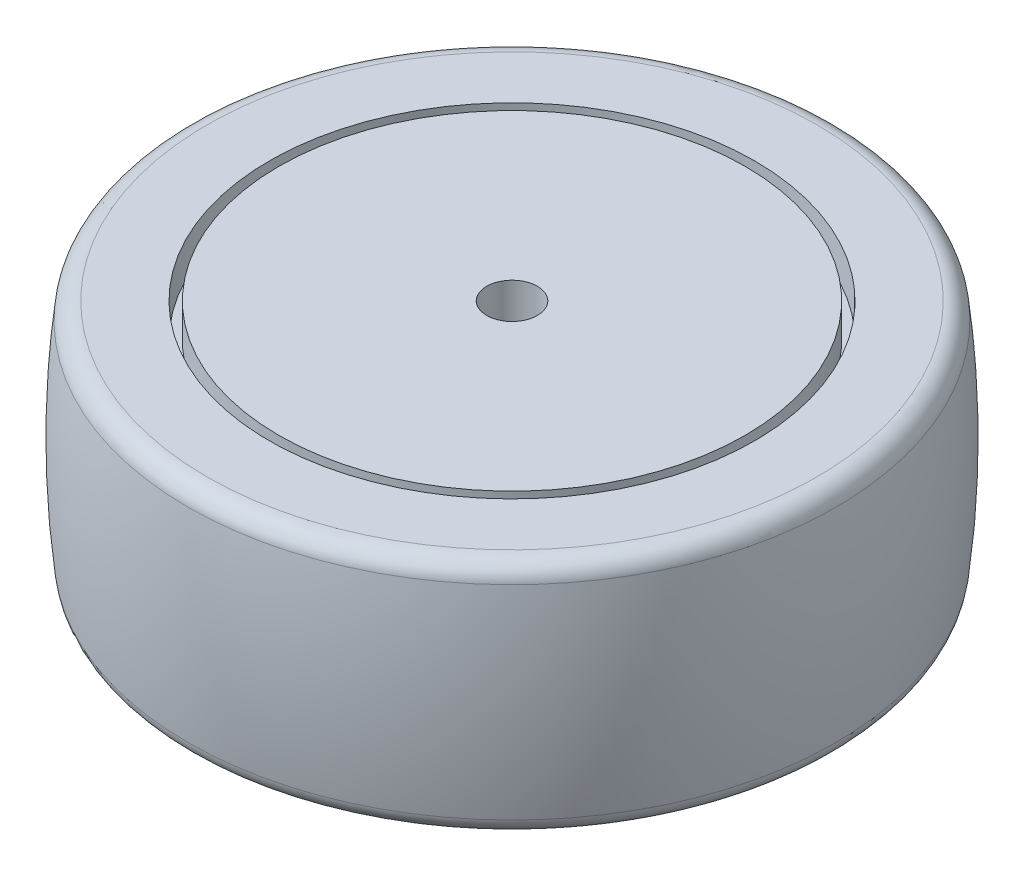
ISO-10303-21;
HEADER;
FILE_DESCRIPTION(('STEP AP214'),'2;1');
FILE_NAME('part.step','',(''),(''),'','','');
FILE_SCHEMA(('AUTOMOTIVE_DESIGN { 1 0 10303 214 1 1 1 1 }'));
ENDSEC;
DATA;
#1=APPLICATION_CONTEXT('core data for automotive mechanical design processes');
#2=APPLICATION_PROTOCOL_DEFINITION('international standard','automotive_design',2000,#1);
#3=PRODUCT_CONTEXT('',#1,'mechanical');
#4=PRODUCT('Part','Part','',(#3));
#5=PRODUCT_RELATED_PRODUCT_CATEGORY('part','',(#4));
#6=PRODUCT_DEFINITION_FORMATION('','',#4);
#7=PRODUCT_DEFINITION_CONTEXT('part definition',#1,'design');
#8=PRODUCT_DEFINITION('design','',#6,#7);
#9=PRODUCT_DEFINITION_SHAPE('','',#8);
#10=(LENGTH_UNIT() NAMED_UNIT(*) SI_UNIT(.MILLI.,.METRE.));
#11=(NAMED_UNIT(*) PLANE_ANGLE_UNIT() SI_UNIT($,.RADIAN.));
#12=(NAMED_UNIT(*) SI_UNIT($,.STERADIAN.) SOLID_ANGLE_UNIT());
#13=UNCERTAINTY_MEASURE_WITH_UNIT(LENGTH_MEASURE(1.E-05),#10,'distance_accuracy_value','');
#14=(GEOMETRIC_REPRESENTATION_CONTEXT(3) GLOBAL_UNCERTAINTY_ASSIGNED_CONTEXT((#13)) GLOBAL_UNIT_ASSIGNED_CONTEXT((#10,
#11,#12)) REPRESENTATION_CONTEXT('',''));
#15=CARTESIAN_POINT('',(0.,0.,0.));
#16=DIRECTION('',(0.,0.,1.));
#17=DIRECTION('',(1.,0.,0.));
#18=AXIS2_PLACEMENT_3D('',#15,#16,#17);
#19=CARTESIAN_POINT('',(0.,18.75,0.));
#20=DIRECTION('',(0.,1.,0.));
#21=DIRECTION('',(0.,0.,1.));
#22=AXIS2_PLACEMENT_3D('',#19,#20,#21);
#23=PLANE('',#22);
#24=CARTESIAN_POINT('',(0.,18.75,0.));
#25=DIRECTION('',(0.,1.,0.));
#26=DIRECTION('',(0.,0.,1.));
#27=AXIS2_PLACEMENT_3D('',#24,#25,#26);
#28=CIRCLE('',#27,48.147149503569);
#29=CARTESIAN_POINT('',(0.,18.75,48.147149503569));
#30=VERTEX_POINT('',#29);
#31=EDGE_CURVE('E10',#30,#30,#28,.T.);
#32=ORIENTED_EDGE('',*,*,#31,.T.);
#33=EDGE_LOOP('',(#32));
#34=FACE_BOUND('',#33,.T.);
#35=CARTESIAN_POINT('',(0.,18.75,0.));
#36=DIRECTION('',(0.,-1.,0.));
#37=DIRECTION('',(0.,0.,-1.));
#38=AXIS2_PLACEMENT_3D('',#35,#36,#37);
#39=CIRCLE('',#38,38.3);
#40=CARTESIAN_POINT('',(0.,18.75,-38.3));
#41=VERTEX_POINT('',#40);
#42=EDGE_CURVE('E75',#41,#41,#39,.T.);
#43=ORIENTED_EDGE('',*,*,#42,.T.);
#44=EDGE_LOOP('',(#43));
#45=FACE_BOUND('',#44,.T.);
#46=ADVANCED_FACE('F34',(#34,#45),#23,.T.);
#47=CARTESIAN_POINT('',(0.,0.,0.));
#48=DIRECTION('',(0.,-1.,0.));
#49=DIRECTION('',(0.,0.,-1.));
#50=AXIS2_PLACEMENT_3D('',#47,#48,#49);
#51=DEGENERATE_TOROIDAL_SURFACE('',#50,90.3852773521191,142.424875078038,.F.);
#52=CARTESIAN_POINT('',(0.,-16.0888921809939,0.));
#53=DIRECTION('',(0.,1.,0.));
#54=DIRECTION('',(0.,0.,1.));
#55=AXIS2_PLACEMENT_3D('',#52,#53,#54);
#56=CIRCLE('',#55,51.1279467274105);
#57=CARTESIAN_POINT('',(0.,-16.0888921809939,51.1279467274105));
#58=VERTEX_POINT('',#57);
#59=EDGE_CURVE('E41',#58,#58,#56,.T.);
#60=ORIENTED_EDGE('',*,*,#59,.T.);
#61=EDGE_LOOP('',(#60));
#62=FACE_BOUND('',#61,.T.);
#63=CARTESIAN_POINT('',(0.,16.0888921809939,0.));
#64=DIRECTION('',(0.,-1.,0.));
#65=DIRECTION('',(0.,0.,-1.));
#66=AXIS2_PLACEMENT_3D('',#63,#64,#65);
#67=CIRCLE('',#66,51.1279467274105);
#68=CARTESIAN_POINT('',(0.,16.0888921809939,-51.1279467274105));
#69=VERTEX_POINT('',#68);
#70=EDGE_CURVE('E45',#69,#69,#67,.T.);
#71=ORIENTED_EDGE('',*,*,#70,.T.);
#72=EDGE_LOOP('',(#71));
#73=FACE_BOUND('',#72,.T.);
#74=ADVANCED_FACE('F114',(#62,#73),#51,.F.);
#75=CARTESIAN_POINT('',(0.,-18.75,0.));
#76=DIRECTION('',(0.,1.,0.));
#77=DIRECTION('',(0.,0.,1.));
#78=AXIS2_PLACEMENT_3D('',#75,#76,#77);
#79=PLANE('',#78);
#80=CARTESIAN_POINT('',(0.,-18.75,0.));
#81=DIRECTION('',(0.,1.,0.));
#82=DIRECTION('',(0.,0.,1.));
#83=AXIS2_PLACEMENT_3D('',#80,#81,#82);
#84=CIRCLE('',#83,48.147149503569);
#85=CARTESIAN_POINT('',(0.,-18.75,48.147149503569));
#86=VERTEX_POINT('',#85);
#87=EDGE_CURVE('E49',#86,#86,#84,.F.);
#88=ORIENTED_EDGE('',*,*,#87,.T.);
#89=EDGE_LOOP('',(#88));
#90=FACE_BOUND('',#89,.T.);
#91=CARTESIAN_POINT('',(0.,-18.75,0.));
#92=DIRECTION('',(0.,-1.,0.));
#93=DIRECTION('',(0.,0.,-1.));
#94=AXIS2_PLACEMENT_3D('',#91,#92,#93);
#95=CIRCLE('',#94,38.3);
#96=CARTESIAN_POINT('',(0.,-18.75,-38.3));
#97=VERTEX_POINT('',#96);
#98=EDGE_CURVE('E54',#97,#97,#95,.T.);
#99=ORIENTED_EDGE('',*,*,#98,.F.);
#100=EDGE_LOOP('',(#99));
#101=FACE_BOUND('',#100,.T.);
#102=ADVANCED_FACE('F119',(#90,#101),#79,.F.);
#103=CARTESIAN_POINT('',(0.,-18.75,0.));
#104=DIRECTION('',(0.,-1.,0.));
#105=DIRECTION('',(0.,0.,-1.));
#106=AXIS2_PLACEMENT_3D('',#103,#104,#105);
#107=CYLINDRICAL_SURFACE('',#106,38.3);
#108=CARTESIAN_POINT('',(0.,-13.2825304000738,0.));
#109=DIRECTION('',(0.,-1.,0.));
#110=DIRECTION('',(0.,0.,-1.));
#111=AXIS2_PLACEMENT_3D('',#108,#109,#110);
#112=CIRCLE('',#111,38.3);
#113=CARTESIAN_POINT('',(0.,-13.2825304000738,-38.3));
#114=VERTEX_POINT('',#113);
#115=EDGE_CURVE('E57',#114,#114,#112,.T.);
#116=ORIENTED_EDGE('',*,*,#115,.F.);
#117=EDGE_LOOP('',(#116));
#118=FACE_BOUND('',#117,.T.);
#119=ORIENTED_EDGE('',*,*,#98,.T.);
#120=EDGE_LOOP('',(#119));
#121=FACE_BOUND('',#120,.T.);
#122=ADVANCED_FACE('F133',(#118,#121),#107,.F.);
#123=CARTESIAN_POINT('',(0.,-13.2825304000738,0.));
#124=DIRECTION('',(0.,1.,0.));
#125=DIRECTION('',(0.,0.,1.));
#126=AXIS2_PLACEMENT_3D('',#123,#124,#125);
#127=PLANE('',#126);
#128=CARTESIAN_POINT('',(0.,-13.2825304000738,0.));
#129=DIRECTION('',(0.,-1.,0.));
#130=DIRECTION('',(0.,0.,-1.));
#131=AXIS2_PLACEMENT_3D('',#128,#129,#130);
#132=CIRCLE('',#131,36.8);
#133=CARTESIAN_POINT('',(0.,-13.2825304000738,-36.8));
#134=VERTEX_POINT('',#133);
#135=EDGE_CURVE('E60',#134,#134,#132,.T.);
#136=ORIENTED_EDGE('',*,*,#135,.F.);
#137=EDGE_LOOP('',(#136));
#138=FACE_BOUND('',#137,.T.);
#139=ORIENTED_EDGE('',*,*,#115,.T.);
#140=EDGE_LOOP('',(#139));
#141=FACE_BOUND('',#140,.T.);
#142=ADVANCED_FACE('F137',(#138,#141),#127,.F.);
#143=CARTESIAN_POINT('',(0.,-18.75,0.));
#144=DIRECTION('',(0.,-1.,0.));
#145=DIRECTION('',(0.,0.,-1.));
#146=AXIS2_PLACEMENT_3D('',#143,#144,#145);
#147=CYLINDRICAL_SURFACE('',#146,36.8);
#148=CARTESIAN_POINT('',(0.,-18.75,0.));
#149=DIRECTION('',(0.,-1.,0.));
#150=DIRECTION('',(0.,0.,-1.));
#151=AXIS2_PLACEMENT_3D('',#148,#149,#150);
#152=CIRCLE('',#151,36.8);
#153=CARTESIAN_POINT('',(0.,-18.75,-36.8));
#154=VERTEX_POINT('',#153);
#155=EDGE_CURVE('E63',#154,#154,#152,.T.);
#156=ORIENTED_EDGE('',*,*,#155,.F.);
#157=EDGE_LOOP('',(#156));
#158=FACE_BOUND('',#157,.T.);
#159=ORIENTED_EDGE('',*,*,#135,.T.);
#160=EDGE_LOOP('',(#159));
#161=FACE_BOUND('',#160,.T.);
#162=ADVANCED_FACE('F143',(#158,#161),#147,.T.);
#163=CARTESIAN_POINT('',(0.,-18.75,0.));
#164=DIRECTION('',(0.,-1.,0.));
#165=DIRECTION('',(0.,0.,-1.));
#166=AXIS2_PLACEMENT_3D('',#163,#164,#165);
#167=PLANE('',#166);
#168=CARTESIAN_POINT('',(0.,-18.75,0.));
#169=DIRECTION('',(0.,-1.,0.));
#170=DIRECTION('',(0.,0.,-1.));
#171=AXIS2_PLACEMENT_3D('',#168,#169,#170);
#172=CIRCLE('',#171,4.);
#173=CARTESIAN_POINT('',(0.,-18.75,-4.));
#174=VERTEX_POINT('',#173);
#175=EDGE_CURVE('E78',#174,#174,#172,.T.);
#176=ORIENTED_EDGE('',*,*,#175,.F.);
#177=EDGE_LOOP('',(#176));
#178=FACE_BOUND('',#177,.T.);
#179=ORIENTED_EDGE('',*,*,#155,.T.);
#180=EDGE_LOOP('',(#179));
#181=FACE_BOUND('',#180,.T.);
#182=ADVANCED_FACE('F91',(#178,#181),#167,.T.);
#183=CARTESIAN_POINT('',(0.,18.75,0.));
#184=DIRECTION('',(0.,1.,0.));
#185=DIRECTION('',(0.,0.,1.));
#186=AXIS2_PLACEMENT_3D('',#183,#184,#185);
#187=PLANE('',#186);
#188=CARTESIAN_POINT('',(0.,18.75,0.));
#189=DIRECTION('',(0.,1.,0.));
#190=DIRECTION('',(0.,0.,1.));
#191=AXIS2_PLACEMENT_3D('',#188,#189,#190);
#192=CIRCLE('',#191,4.);
#193=CARTESIAN_POINT('',(0.,18.75,4.));
#194=VERTEX_POINT('',#193);
#195=EDGE_CURVE('E81',#194,#194,#192,.T.);
#196=ORIENTED_EDGE('',*,*,#195,.F.);
#197=EDGE_LOOP('',(#196));
#198=FACE_BOUND('',#197,.T.);
#199=CARTESIAN_POINT('',(0.,18.75,0.));
#200=DIRECTION('',(0.,-1.,0.));
#201=DIRECTION('',(0.,0.,-1.));
#202=AXIS2_PLACEMENT_3D('',#199,#200,#201);
#203=CIRCLE('',#202,36.8);
#204=CARTESIAN_POINT('',(0.,18.75,-36.8));
#205=VERTEX_POINT('',#204);
#206=EDGE_CURVE('E66',#205,#205,#203,.T.);
#207=ORIENTED_EDGE('',*,*,#206,.F.);
#208=EDGE_LOOP('',(#207));
#209=FACE_BOUND('',#208,.T.);
#210=ADVANCED_FACE('F87',(#198,#209),#187,.T.);
#211=CARTESIAN_POINT('',(0.,-18.75,0.));
#212=DIRECTION('',(0.,-1.,0.));
#213=DIRECTION('',(0.,0.,-1.));
#214=AXIS2_PLACEMENT_3D('',#211,#212,#213);
#215=CYLINDRICAL_SURFACE('',#214,36.8);
#216=ORIENTED_EDGE('',*,*,#206,.T.);
#217=EDGE_LOOP('',(#216));
#218=FACE_BOUND('',#217,.T.);
#219=CARTESIAN_POINT('',(0.,13.2825304000738,0.));
#220=DIRECTION('',(0.,-1.,0.));
#221=DIRECTION('',(0.,0.,-1.));
#222=AXIS2_PLACEMENT_3D('',#219,#220,#221);
#223=CIRCLE('',#222,36.8);
#224=CARTESIAN_POINT('',(0.,13.2825304000738,-36.8));
#225=VERTEX_POINT('',#224);
#226=EDGE_CURVE('E69',#225,#225,#223,.T.);
#227=ORIENTED_EDGE('',*,*,#226,.F.);
#228=EDGE_LOOP('',(#227));
#229=FACE_BOUND('',#228,.T.);
#230=ADVANCED_FACE('F90',(#218,#229),#215,.T.);
#231=CARTESIAN_POINT('',(0.,13.2825304000738,0.));
#232=DIRECTION('',(0.,1.,0.));
#233=DIRECTION('',(0.,0.,1.));
#234=AXIS2_PLACEMENT_3D('',#231,#232,#233);
#235=PLANE('',#234);
#236=ORIENTED_EDGE('',*,*,#226,.T.);
#237=EDGE_LOOP('',(#236));
#238=FACE_BOUND('',#237,.T.);
#239=CARTESIAN_POINT('',(0.,13.2825304000738,0.));
#240=DIRECTION('',(0.,-1.,0.));
#241=DIRECTION('',(0.,0.,-1.));
#242=AXIS2_PLACEMENT_3D('',#239,#240,#241);
#243=CIRCLE('',#242,38.3);
#244=CARTESIAN_POINT('',(0.,13.2825304000738,-38.3));
#245=VERTEX_POINT('',#244);
#246=EDGE_CURVE('E72',#245,#245,#243,.T.);
#247=ORIENTED_EDGE('',*,*,#246,.F.);
#248=EDGE_LOOP('',(#247));
#249=FACE_BOUND('',#248,.T.);
#250=ADVANCED_FACE('F97',(#238,#249),#235,.T.);
#251=CARTESIAN_POINT('',(0.,-18.75,0.));
#252=DIRECTION('',(0.,-1.,0.));
#253=DIRECTION('',(0.,0.,-1.));
#254=AXIS2_PLACEMENT_3D('',#251,#252,#253);
#255=CYLINDRICAL_SURFACE('',#254,38.3);
#256=ORIENTED_EDGE('',*,*,#246,.T.);
#257=EDGE_LOOP('',(#256));
#258=FACE_BOUND('',#257,.T.);
#259=ORIENTED_EDGE('',*,*,#42,.F.);
#260=EDGE_LOOP('',(#259));
#261=FACE_BOUND('',#260,.T.);
#262=ADVANCED_FACE('F103',(#258,#261),#255,.F.);
#263=CARTESIAN_POINT('',(0.,-15.75,0.));
#264=DIRECTION('',(0.,1.,0.));
#265=DIRECTION('',(0.,0.,1.));
#266=AXIS2_PLACEMENT_3D('',#263,#264,#265);
#267=TOROIDAL_SURFACE('',#266,48.147149503569,3.);
#268=ORIENTED_EDGE('',*,*,#59,.F.);
#269=EDGE_LOOP('',(#268));
#270=FACE_BOUND('',#269,.T.);
#271=ORIENTED_EDGE('',*,*,#87,.F.);
#272=EDGE_LOOP('',(#271));
#273=FACE_BOUND('',#272,.T.);
#274=ADVANCED_FACE('F109',(#270,#273),#267,.T.);
#275=CARTESIAN_POINT('',(0.,15.75,0.));
#276=DIRECTION('',(0.,1.,0.));
#277=DIRECTION('',(0.,0.,1.));
#278=AXIS2_PLACEMENT_3D('',#275,#276,#277);
#279=TOROIDAL_SURFACE('',#278,48.147149503569,3.);
#280=ORIENTED_EDGE('',*,*,#31,.F.);
#281=EDGE_LOOP('',(#280));
#282=FACE_BOUND('',#281,.T.);
#283=ORIENTED_EDGE('',*,*,#70,.F.);
#284=EDGE_LOOP('',(#283));
#285=FACE_BOUND('',#284,.T.);
#286=ADVANCED_FACE('F36',(#282,#285),#279,.T.);
#287=CARTESIAN_POINT('',(0.,-118.25,0.));
#288=DIRECTION('',(0.,1.,0.));
#289=DIRECTION('',(0.,0.,1.));
#290=AXIS2_PLACEMENT_3D('',#287,#288,#289);
#291=CYLINDRICAL_SURFACE('',#290,4.);
#292=ORIENTED_EDGE('',*,*,#175,.T.);
#293=EDGE_LOOP('',(#292));
#294=FACE_BOUND('',#293,.T.);
#295=ORIENTED_EDGE('',*,*,#195,.T.);
#296=EDGE_LOOP('',(#295));
#297=FACE_BOUND('',#296,.T.);
#298=ADVANCED_FACE('F85',(#294,#297),#291,.F.);
#299=CLOSED_SHELL('',(#46,#74,#102,#122,#142,#162,#182,#210,#230,#250,#262,#274,#286,#298));
#300=MANIFOLD_SOLID_BREP('B2',#299);
#301=ADVANCED_BREP_SHAPE_REPRESENTATION('',(#18,#300),#14);
#302=SHAPE_DEFINITION_REPRESENTATION(#9,#301);
ENDSEC;
END-ISO-10303-21;
